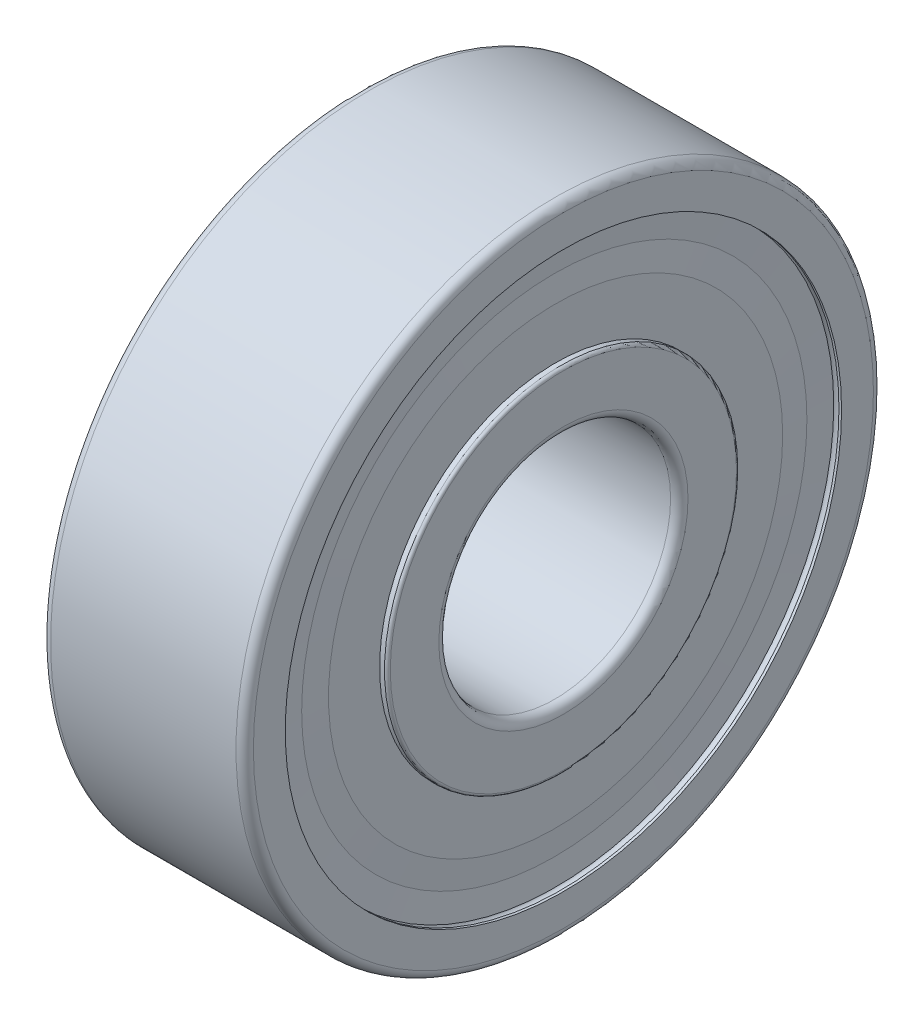
ISO-10303-21;
HEADER;
FILE_DESCRIPTION(('STEP AP214'),'2;1');
FILE_NAME('part.step','',(''),(''),'','','');
FILE_SCHEMA(('AUTOMOTIVE_DESIGN { 1 0 10303 214 1 1 1 1 }'));
ENDSEC;
DATA;
#1=APPLICATION_CONTEXT('core data for automotive mechanical design processes');
#2=APPLICATION_PROTOCOL_DEFINITION('international standard','automotive_design',2000,#1);
#3=PRODUCT_CONTEXT('',#1,'mechanical');
#4=PRODUCT('Part','Part','',(#3));
#5=PRODUCT_RELATED_PRODUCT_CATEGORY('part','',(#4));
#6=PRODUCT_DEFINITION_FORMATION('','',#4);
#7=PRODUCT_DEFINITION_CONTEXT('part definition',#1,'design');
#8=PRODUCT_DEFINITION('design','',#6,#7);
#9=PRODUCT_DEFINITION_SHAPE('','',#8);
#10=(LENGTH_UNIT() NAMED_UNIT(*) SI_UNIT(.MILLI.,.METRE.));
#11=(NAMED_UNIT(*) PLANE_ANGLE_UNIT() SI_UNIT($,.RADIAN.));
#12=(NAMED_UNIT(*) SI_UNIT($,.STERADIAN.) SOLID_ANGLE_UNIT());
#13=UNCERTAINTY_MEASURE_WITH_UNIT(LENGTH_MEASURE(1.E-05),#10,'distance_accuracy_value','');
#14=(GEOMETRIC_REPRESENTATION_CONTEXT(3) GLOBAL_UNCERTAINTY_ASSIGNED_CONTEXT((#13)) GLOBAL_UNIT_ASSIGNED_CONTEXT((#10,
#11,#12)) REPRESENTATION_CONTEXT('',''));
#15=CARTESIAN_POINT('',(0.,0.,0.));
#16=DIRECTION('',(0.,0.,1.));
#17=DIRECTION('',(1.,0.,0.));
#18=AXIS2_PLACEMENT_3D('',#15,#16,#17);
#19=CARTESIAN_POINT('',(6.64,0.,0.));
#20=DIRECTION('',(1.,0.,0.));
#21=DIRECTION('',(0.,0.,-1.));
#22=AXIS2_PLACEMENT_3D('',#19,#20,#21);
#23=CONICAL_SURFACE('',#22,9.6,1.4690215275);
#24=CARTESIAN_POINT('',(6.55,0.,0.));
#25=DIRECTION('',(1.,0.,0.));
#26=DIRECTION('',(0.,0.,-1.));
#27=AXIS2_PLACEMENT_3D('',#24,#25,#26);
#28=CIRCLE('',#27,8.71875);
#29=CARTESIAN_POINT('',(6.55,0.,-8.71875));
#30=VERTEX_POINT('',#29);
#31=EDGE_CURVE('P0_E562',#30,#30,#28,.T.);
#32=ORIENTED_EDGE('',*,*,#31,.T.);
#33=EDGE_LOOP('',(#32));
#34=FACE_BOUND('',#33,.T.);
#35=CARTESIAN_POINT('',(6.64,0.,0.));
#36=DIRECTION('',(1.,0.,0.));
#37=DIRECTION('',(0.,0.,-1.));
#38=AXIS2_PLACEMENT_3D('',#35,#36,#37);
#39=CIRCLE('',#38,9.6);
#40=CARTESIAN_POINT('',(6.64,0.,-9.6));
#41=VERTEX_POINT('',#40);
#42=EDGE_CURVE('P0_E11',#41,#41,#39,.T.);
#43=ORIENTED_EDGE('',*,*,#42,.F.);
#44=EDGE_LOOP('',(#43));
#45=FACE_BOUND('',#44,.T.);
#46=ADVANCED_FACE('P0_F16',(#34,#45),#23,.T.);
#47=CARTESIAN_POINT('',(50.,0.,0.));
#48=DIRECTION('',(-1.,0.,0.));
#49=DIRECTION('',(0.,0.,-1.));
#50=AXIS2_PLACEMENT_3D('',#47,#48,#49);
#51=CYLINDRICAL_SURFACE('',#50,9.6);
#52=ORIENTED_EDGE('',*,*,#42,.T.);
#53=EDGE_LOOP('',(#52));
#54=FACE_BOUND('',#53,.T.);
#55=CARTESIAN_POINT('',(6.73,0.,0.));
#56=DIRECTION('',(1.,0.,0.));
#57=DIRECTION('',(0.,0.,-1.));
#58=AXIS2_PLACEMENT_3D('',#55,#56,#57);
#59=CIRCLE('',#58,9.6);
#60=CARTESIAN_POINT('',(6.73,0.,-9.6));
#61=VERTEX_POINT('',#60);
#62=EDGE_CURVE('P0_E27',#61,#61,#59,.T.);
#63=ORIENTED_EDGE('',*,*,#62,.F.);
#64=EDGE_LOOP('',(#63));
#65=FACE_BOUND('',#64,.T.);
#66=ADVANCED_FACE('P0_F224',(#54,#65),#51,.T.);
#67=CARTESIAN_POINT('',(6.685,0.,0.));
#68=DIRECTION('',(1.,0.,0.));
#69=DIRECTION('',(0.,0.,-1.));
#70=AXIS2_PLACEMENT_3D('',#67,#68,#69);
#71=CONICAL_SURFACE('',#70,8.71875,1.5197768109);
#72=CARTESIAN_POINT('',(6.685,0.,0.));
#73=DIRECTION('',(1.,0.,0.));
#74=DIRECTION('',(0.,0.,-1.));
#75=AXIS2_PLACEMENT_3D('',#72,#73,#74);
#76=CIRCLE('',#75,8.71875);
#77=CARTESIAN_POINT('',(6.685,0.,-8.71875));
#78=VERTEX_POINT('',#77);
#79=EDGE_CURVE('P0_E143',#78,#78,#76,.T.);
#80=ORIENTED_EDGE('',*,*,#79,.F.);
#81=EDGE_LOOP('',(#80));
#82=FACE_BOUND('',#81,.T.);
#83=ORIENTED_EDGE('',*,*,#62,.T.);
#84=EDGE_LOOP('',(#83));
#85=FACE_BOUND('',#84,.T.);
#86=ADVANCED_FACE('P0_F230',(#82,#85),#71,.F.);
#87=CARTESIAN_POINT('',(6.73,0.,0.));
#88=DIRECTION('',(-1.,0.,0.));
#89=DIRECTION('',(0.,0.,1.));
#90=AXIS2_PLACEMENT_3D('',#87,#88,#89);
#91=CONICAL_SURFACE('',#90,7.8375,1.5197768109);
#92=CARTESIAN_POINT('',(6.73,0.,0.));
#93=DIRECTION('',(1.,0.,0.));
#94=DIRECTION('',(0.,0.,-1.));
#95=AXIS2_PLACEMENT_3D('',#92,#93,#94);
#96=CIRCLE('',#95,7.8375);
#97=CARTESIAN_POINT('',(6.73,0.,-7.8375));
#98=VERTEX_POINT('',#97);
#99=EDGE_CURVE('P0_E146',#98,#98,#96,.T.);
#100=ORIENTED_EDGE('',*,*,#99,.F.);
#101=EDGE_LOOP('',(#100));
#102=FACE_BOUND('',#101,.T.);
#103=ORIENTED_EDGE('',*,*,#79,.T.);
#104=EDGE_LOOP('',(#103));
#105=FACE_BOUND('',#104,.T.);
#106=ADVANCED_FACE('P0_F246',(#102,#105),#91,.T.);
#107=CARTESIAN_POINT('',(6.73,6.075,0.));
#108=DIRECTION('',(1.,0.,0.));
#109=DIRECTION('',(0.,1.,0.));
#110=AXIS2_PLACEMENT_3D('',#107,#108,#109);
#111=PLANE('',#110);
#112=CARTESIAN_POINT('',(6.73,0.,0.));
#113=DIRECTION('',(1.,0.,0.));
#114=DIRECTION('',(0.,0.,-1.));
#115=AXIS2_PLACEMENT_3D('',#112,#113,#114);
#116=CIRCLE('',#115,6.075);
#117=CARTESIAN_POINT('',(6.73,0.,-6.075));
#118=VERTEX_POINT('',#117);
#119=EDGE_CURVE('P0_E120',#118,#118,#116,.T.);
#120=ORIENTED_EDGE('',*,*,#119,.F.);
#121=EDGE_LOOP('',(#120));
#122=FACE_BOUND('',#121,.T.);
#123=ORIENTED_EDGE('',*,*,#99,.T.);
#124=EDGE_LOOP('',(#123));
#125=FACE_BOUND('',#124,.T.);
#126=ADVANCED_FACE('P0_F249',(#122,#125),#111,.T.);
#127=CARTESIAN_POINT('',(50.,0.,0.));
#128=DIRECTION('',(-1.,0.,0.));
#129=DIRECTION('',(0.,0.,-1.));
#130=AXIS2_PLACEMENT_3D('',#127,#128,#129);
#131=CYLINDRICAL_SURFACE('',#130,6.075);
#132=CARTESIAN_POINT('',(0.36,0.,0.));
#133=DIRECTION('',(1.,0.,0.));
#134=DIRECTION('',(0.,0.,-1.));
#135=AXIS2_PLACEMENT_3D('',#132,#133,#134);
#136=CIRCLE('',#135,6.075);
#137=CARTESIAN_POINT('',(0.36,0.,-6.075));
#138=VERTEX_POINT('',#137);
#139=EDGE_CURVE('P0_E167',#138,#138,#136,.T.);
#140=ORIENTED_EDGE('',*,*,#139,.T.);
#141=EDGE_LOOP('',(#140));
#142=FACE_BOUND('',#141,.T.);
#143=CARTESIAN_POINT('',(1.979271473931,0.,0.));
#144=DIRECTION('',(1.,0.,0.));
#145=DIRECTION('',(0.,0.,-1.));
#146=AXIS2_PLACEMENT_3D('',#143,#144,#145);
#147=CIRCLE('',#146,6.075);
#148=CARTESIAN_POINT('',(1.979271473931,0.,-6.075));
#149=VERTEX_POINT('',#148);
#150=EDGE_CURVE('P0_E127',#149,#149,#147,.T.);
#151=ORIENTED_EDGE('',*,*,#150,.F.);
#152=EDGE_LOOP('',(#151));
#153=FACE_BOUND('',#152,.T.);
#154=ADVANCED_FACE('P0_F244',(#142,#153),#131,.T.);
#155=CARTESIAN_POINT('',(0.36,0.,0.));
#156=DIRECTION('',(1.,0.,0.));
#157=DIRECTION('',(0.,0.,-1.));
#158=AXIS2_PLACEMENT_3D('',#155,#156,#157);
#159=CONICAL_SURFACE('',#158,6.075,1.5197768109);
#160=ORIENTED_EDGE('',*,*,#139,.F.);
#161=EDGE_LOOP('',(#160));
#162=FACE_BOUND('',#161,.T.);
#163=CARTESIAN_POINT('',(0.45,0.,0.));
#164=DIRECTION('',(1.,0.,0.));
#165=DIRECTION('',(0.,0.,-1.));
#166=AXIS2_PLACEMENT_3D('',#163,#164,#165);
#167=CIRCLE('',#166,7.8375);
#168=CARTESIAN_POINT('',(0.45,0.,-7.8375));
#169=VERTEX_POINT('',#168);
#170=EDGE_CURVE('P0_E169',#169,#169,#167,.T.);
#171=ORIENTED_EDGE('',*,*,#170,.T.);
#172=EDGE_LOOP('',(#171));
#173=FACE_BOUND('',#172,.T.);
#174=ADVANCED_FACE('P0_F240',(#162,#173),#159,.F.);
#175=CARTESIAN_POINT('',(0.45,7.8375,0.));
#176=DIRECTION('',(1.,0.,0.));
#177=DIRECTION('',(0.,1.,0.));
#178=AXIS2_PLACEMENT_3D('',#175,#176,#177);
#179=PLANE('',#178);
#180=ORIENTED_EDGE('',*,*,#170,.F.);
#181=EDGE_LOOP('',(#180));
#182=FACE_BOUND('',#181,.T.);
#183=CARTESIAN_POINT('',(0.45,0.,0.));
#184=DIRECTION('',(1.,0.,0.));
#185=DIRECTION('',(0.,0.,-1.));
#186=AXIS2_PLACEMENT_3D('',#183,#184,#185);
#187=CIRCLE('',#186,8.71875);
#188=CARTESIAN_POINT('',(0.45,0.,-8.71875));
#189=VERTEX_POINT('',#188);
#190=EDGE_CURVE('P0_E177',#189,#189,#187,.T.);
#191=ORIENTED_EDGE('',*,*,#190,.T.);
#192=EDGE_LOOP('',(#191));
#193=FACE_BOUND('',#192,.T.);
#194=ADVANCED_FACE('P0_F243',(#182,#193),#179,.T.);
#195=CARTESIAN_POINT('',(50.,0.,0.));
#196=DIRECTION('',(-1.,0.,0.));
#197=DIRECTION('',(0.,0.,-1.));
#198=AXIS2_PLACEMENT_3D('',#195,#196,#197);
#199=CYLINDRICAL_SURFACE('',#198,9.6);
#200=CARTESIAN_POINT('',(0.27,0.,0.));
#201=DIRECTION('',(1.,0.,0.));
#202=DIRECTION('',(0.,0.,-1.));
#203=AXIS2_PLACEMENT_3D('',#200,#201,#202);
#204=CIRCLE('',#203,9.6);
#205=CARTESIAN_POINT('',(0.27,0.,-9.6));
#206=VERTEX_POINT('',#205);
#207=EDGE_CURVE('P0_E20',#206,#206,#204,.T.);
#208=ORIENTED_EDGE('',*,*,#207,.T.);
#209=EDGE_LOOP('',(#208));
#210=FACE_BOUND('',#209,.T.);
#211=CARTESIAN_POINT('',(0.36,0.,0.));
#212=DIRECTION('',(1.,0.,0.));
#213=DIRECTION('',(0.,0.,-1.));
#214=AXIS2_PLACEMENT_3D('',#211,#212,#213);
#215=CIRCLE('',#214,9.6);
#216=CARTESIAN_POINT('',(0.36,0.,-9.6));
#217=VERTEX_POINT('',#216);
#218=EDGE_CURVE('P0_E173',#217,#217,#215,.T.);
#219=ORIENTED_EDGE('',*,*,#218,.F.);
#220=EDGE_LOOP('',(#219));
#221=FACE_BOUND('',#220,.T.);
#222=ADVANCED_FACE('P0_F258',(#210,#221),#199,.T.);
#223=CARTESIAN_POINT('',(0.27,0.,0.));
#224=DIRECTION('',(-1.,0.,0.));
#225=DIRECTION('',(0.,0.,1.));
#226=AXIS2_PLACEMENT_3D('',#223,#224,#225);
#227=CONICAL_SURFACE('',#226,9.6,1.5197768109);
#228=CARTESIAN_POINT('',(0.315,0.,0.));
#229=DIRECTION('',(1.,0.,0.));
#230=DIRECTION('',(0.,0.,-1.));
#231=AXIS2_PLACEMENT_3D('',#228,#229,#230);
#232=CIRCLE('',#231,8.71875);
#233=CARTESIAN_POINT('',(0.315,0.,-8.71875));
#234=VERTEX_POINT('',#233);
#235=EDGE_CURVE('P0_E182',#234,#234,#232,.T.);
#236=ORIENTED_EDGE('',*,*,#235,.T.);
#237=EDGE_LOOP('',(#236));
#238=FACE_BOUND('',#237,.T.);
#239=ORIENTED_EDGE('',*,*,#207,.F.);
#240=EDGE_LOOP('',(#239));
#241=FACE_BOUND('',#240,.T.);
#242=ADVANCED_FACE('P0_F219',(#238,#241),#227,.F.);
#243=CARTESIAN_POINT('',(0.315,0.,0.));
#244=DIRECTION('',(1.,0.,0.));
#245=DIRECTION('',(0.,0.,-1.));
#246=AXIS2_PLACEMENT_3D('',#243,#244,#245);
#247=CONICAL_SURFACE('',#246,8.71875,1.5197768109);
#248=CARTESIAN_POINT('',(0.27,0.,0.));
#249=DIRECTION('',(1.,0.,0.));
#250=DIRECTION('',(0.,0.,-1.));
#251=AXIS2_PLACEMENT_3D('',#248,#249,#250);
#252=CIRCLE('',#251,7.8375);
#253=CARTESIAN_POINT('',(0.27,0.,-7.8375));
#254=VERTEX_POINT('',#253);
#255=EDGE_CURVE('P0_E185',#254,#254,#252,.T.);
#256=ORIENTED_EDGE('',*,*,#255,.T.);
#257=EDGE_LOOP('',(#256));
#258=FACE_BOUND('',#257,.T.);
#259=ORIENTED_EDGE('',*,*,#235,.F.);
#260=EDGE_LOOP('',(#259));
#261=FACE_BOUND('',#260,.T.);
#262=ADVANCED_FACE('P0_F202',(#258,#261),#247,.T.);
#263=CARTESIAN_POINT('',(0.27,7.8375,0.));
#264=DIRECTION('',(-1.,0.,0.));
#265=DIRECTION('',(0.,0.,1.));
#266=AXIS2_PLACEMENT_3D('',#263,#264,#265);
#267=PLANE('',#266);
#268=CARTESIAN_POINT('',(0.27,0.,0.));
#269=DIRECTION('',(1.,0.,0.));
#270=DIRECTION('',(0.,0.,-1.));
#271=AXIS2_PLACEMENT_3D('',#268,#269,#270);
#272=CIRCLE('',#271,6.075);
#273=CARTESIAN_POINT('',(0.27,0.,-6.075));
#274=VERTEX_POINT('',#273);
#275=EDGE_CURVE('P0_E130',#274,#274,#272,.T.);
#276=ORIENTED_EDGE('',*,*,#275,.T.);
#277=EDGE_LOOP('',(#276));
#278=FACE_BOUND('',#277,.T.);
#279=ORIENTED_EDGE('',*,*,#255,.F.);
#280=EDGE_LOOP('',(#279));
#281=FACE_BOUND('',#280,.T.);
#282=ADVANCED_FACE('P0_F207',(#278,#281),#267,.T.);
#283=CARTESIAN_POINT('',(0.1,0.,0.));
#284=DIRECTION('',(1.,0.,0.));
#285=DIRECTION('',(0.,0.,-1.));
#286=AXIS2_PLACEMENT_3D('',#283,#284,#285);
#287=TOROIDAL_SURFACE('',#286,5.975,0.1);
#288=CARTESIAN_POINT('',(0.,0.,0.));
#289=DIRECTION('',(1.,0.,0.));
#290=DIRECTION('',(0.,0.,-1.));
#291=AXIS2_PLACEMENT_3D('',#288,#289,#290);
#292=CIRCLE('',#291,5.975);
#293=CARTESIAN_POINT('',(0.,0.,-5.975));
#294=VERTEX_POINT('',#293);
#295=EDGE_CURVE('P0_E142',#294,#294,#292,.T.);
#296=ORIENTED_EDGE('',*,*,#295,.T.);
#297=EDGE_LOOP('',(#296));
#298=FACE_BOUND('',#297,.T.);
#299=CARTESIAN_POINT('',(0.100000000000003,0.,0.));
#300=DIRECTION('',(1.,0.,0.));
#301=DIRECTION('',(0.,0.,-1.));
#302=AXIS2_PLACEMENT_3D('',#299,#300,#301);
#303=CIRCLE('',#302,6.075);
#304=CARTESIAN_POINT('',(0.100000000000003,0.,-6.075));
#305=VERTEX_POINT('',#304);
#306=EDGE_CURVE('P0_E121',#305,#305,#303,.T.);
#307=ORIENTED_EDGE('',*,*,#306,.F.);
#308=EDGE_LOOP('',(#307));
#309=FACE_BOUND('',#308,.T.);
#310=ADVANCED_FACE('P0_F209',(#298,#309),#287,.T.);
#311=CARTESIAN_POINT('',(0.,5.975,0.));
#312=DIRECTION('',(-1.,0.,0.));
#313=DIRECTION('',(0.,0.,1.));
#314=AXIS2_PLACEMENT_3D('',#311,#312,#313);
#315=PLANE('',#314);
#316=CARTESIAN_POINT('',(0.,0.,0.));
#317=DIRECTION('',(1.,0.,0.));
#318=DIRECTION('',(0.,0.,-1.));
#319=AXIS2_PLACEMENT_3D('',#316,#317,#318);
#320=CIRCLE('',#319,4.3);
#321=CARTESIAN_POINT('',(0.,0.,-4.3));
#322=VERTEX_POINT('',#321);
#323=EDGE_CURVE('P0_E138',#322,#322,#320,.T.);
#324=ORIENTED_EDGE('',*,*,#323,.T.);
#325=EDGE_LOOP('',(#324));
#326=FACE_BOUND('',#325,.T.);
#327=ORIENTED_EDGE('',*,*,#295,.F.);
#328=EDGE_LOOP('',(#327));
#329=FACE_BOUND('',#328,.T.);
#330=ADVANCED_FACE('P0_F18',(#326,#329),#315,.T.);
#331=CARTESIAN_POINT('',(0.3,0.,0.));
#332=DIRECTION('',(1.,0.,0.));
#333=DIRECTION('',(0.,0.,-1.));
#334=AXIS2_PLACEMENT_3D('',#331,#332,#333);
#335=TOROIDAL_SURFACE('',#334,4.3,0.3);
#336=CARTESIAN_POINT('',(0.3,0.,0.));
#337=DIRECTION('',(1.,0.,0.));
#338=DIRECTION('',(0.,0.,-1.));
#339=AXIS2_PLACEMENT_3D('',#336,#337,#338);
#340=CIRCLE('',#339,4.);
#341=CARTESIAN_POINT('',(0.3,0.,-4.));
#342=VERTEX_POINT('',#341);
#343=EDGE_CURVE('P0_E136',#342,#342,#340,.T.);
#344=ORIENTED_EDGE('',*,*,#343,.T.);
#345=EDGE_LOOP('',(#344));
#346=FACE_BOUND('',#345,.T.);
#347=ORIENTED_EDGE('',*,*,#323,.F.);
#348=EDGE_LOOP('',(#347));
#349=FACE_BOUND('',#348,.T.);
#350=ADVANCED_FACE('P0_F238',(#346,#349),#335,.T.);
#351=CARTESIAN_POINT('',(50.,0.,0.));
#352=DIRECTION('',(-1.,0.,0.));
#353=DIRECTION('',(0.,0.,-1.));
#354=AXIS2_PLACEMENT_3D('',#351,#352,#353);
#355=CYLINDRICAL_SURFACE('',#354,4.);
#356=CARTESIAN_POINT('',(6.7,0.,0.));
#357=DIRECTION('',(1.,0.,0.));
#358=DIRECTION('',(0.,0.,-1.));
#359=AXIS2_PLACEMENT_3D('',#356,#357,#358);
#360=CIRCLE('',#359,4.);
#361=CARTESIAN_POINT('',(6.7,0.,-4.));
#362=VERTEX_POINT('',#361);
#363=EDGE_CURVE('P0_E139',#362,#362,#360,.T.);
#364=ORIENTED_EDGE('',*,*,#363,.T.);
#365=EDGE_LOOP('',(#364));
#366=FACE_BOUND('',#365,.T.);
#367=ORIENTED_EDGE('',*,*,#343,.F.);
#368=EDGE_LOOP('',(#367));
#369=FACE_BOUND('',#368,.T.);
#370=ADVANCED_FACE('P0_F234',(#366,#369),#355,.F.);
#371=CARTESIAN_POINT('',(6.7,0.,0.));
#372=DIRECTION('',(1.,0.,0.));
#373=DIRECTION('',(0.,0.,-1.));
#374=AXIS2_PLACEMENT_3D('',#371,#372,#373);
#375=TOROIDAL_SURFACE('',#374,4.3,0.3);
#376=CARTESIAN_POINT('',(7.,0.,0.));
#377=DIRECTION('',(1.,0.,0.));
#378=DIRECTION('',(0.,0.,-1.));
#379=AXIS2_PLACEMENT_3D('',#376,#377,#378);
#380=CIRCLE('',#379,4.3);
#381=CARTESIAN_POINT('',(7.,0.,-4.3));
#382=VERTEX_POINT('',#381);
#383=EDGE_CURVE('P0_E150',#382,#382,#380,.T.);
#384=ORIENTED_EDGE('',*,*,#383,.T.);
#385=EDGE_LOOP('',(#384));
#386=FACE_BOUND('',#385,.T.);
#387=ORIENTED_EDGE('',*,*,#363,.F.);
#388=EDGE_LOOP('',(#387));
#389=FACE_BOUND('',#388,.T.);
#390=ADVANCED_FACE('P0_F237',(#386,#389),#375,.T.);
#391=CARTESIAN_POINT('',(7.,4.3,0.));
#392=DIRECTION('',(1.,0.,0.));
#393=DIRECTION('',(0.,1.,0.));
#394=AXIS2_PLACEMENT_3D('',#391,#392,#393);
#395=PLANE('',#394);
#396=ORIENTED_EDGE('',*,*,#383,.F.);
#397=EDGE_LOOP('',(#396));
#398=FACE_BOUND('',#397,.T.);
#399=CARTESIAN_POINT('',(7.,0.,0.));
#400=DIRECTION('',(1.,0.,0.));
#401=DIRECTION('',(0.,0.,-1.));
#402=AXIS2_PLACEMENT_3D('',#399,#400,#401);
#403=CIRCLE('',#402,5.975);
#404=CARTESIAN_POINT('',(7.,0.,-5.975));
#405=VERTEX_POINT('',#404);
#406=EDGE_CURVE('P0_E147',#405,#405,#403,.T.);
#407=ORIENTED_EDGE('',*,*,#406,.T.);
#408=EDGE_LOOP('',(#407));
#409=FACE_BOUND('',#408,.T.);
#410=ADVANCED_FACE('P0_F439',(#398,#409),#395,.T.);
#411=CARTESIAN_POINT('',(6.9,0.,0.));
#412=DIRECTION('',(1.,0.,0.));
#413=DIRECTION('',(0.,0.,-1.));
#414=AXIS2_PLACEMENT_3D('',#411,#412,#413);
#415=TOROIDAL_SURFACE('',#414,5.975,0.1);
#416=CARTESIAN_POINT('',(6.9,0.,0.));
#417=DIRECTION('',(1.,0.,0.));
#418=DIRECTION('',(0.,0.,-1.));
#419=AXIS2_PLACEMENT_3D('',#416,#417,#418);
#420=CIRCLE('',#419,6.075);
#421=CARTESIAN_POINT('',(6.9,0.,-6.075));
#422=VERTEX_POINT('',#421);
#423=EDGE_CURVE('P0_E115',#422,#422,#420,.T.);
#424=ORIENTED_EDGE('',*,*,#423,.T.);
#425=EDGE_LOOP('',(#424));
#426=FACE_BOUND('',#425,.T.);
#427=ORIENTED_EDGE('',*,*,#406,.F.);
#428=EDGE_LOOP('',(#427));
#429=FACE_BOUND('',#428,.T.);
#430=ADVANCED_FACE('P0_F116',(#426,#429),#415,.T.);
#431=CARTESIAN_POINT('',(3.5,0.,0.));
#432=DIRECTION('',(1.,0.,0.));
#433=DIRECTION('',(0.,0.,-1.));
#434=AXIS2_PLACEMENT_3D('',#431,#432,#433);
#435=TOROIDAL_SURFACE('',#434,7.35,1.9845);
#436=CARTESIAN_POINT('',(5.020728526069,0.,0.));
#437=DIRECTION('',(1.,0.,0.));
#438=DIRECTION('',(0.,0.,-1.));
#439=AXIS2_PLACEMENT_3D('',#436,#437,#438);
#440=CIRCLE('',#439,6.075);
#441=CARTESIAN_POINT('',(5.020728526069,0.,-6.075));
#442=VERTEX_POINT('',#441);
#443=EDGE_CURVE('P0_E181',#442,#442,#440,.T.);
#444=ORIENTED_EDGE('',*,*,#443,.F.);
#445=EDGE_LOOP('',(#444));
#446=FACE_BOUND('',#445,.T.);
#447=ORIENTED_EDGE('',*,*,#150,.T.);
#448=EDGE_LOOP('',(#447));
#449=FACE_BOUND('',#448,.T.);
#450=ADVANCED_FACE('P0_F254',(#446,#449),#435,.F.);
#451=CARTESIAN_POINT('',(50.,0.,0.));
#452=DIRECTION('',(-1.,0.,0.));
#453=DIRECTION('',(0.,0.,-1.));
#454=AXIS2_PLACEMENT_3D('',#451,#452,#453);
#455=CYLINDRICAL_SURFACE('',#454,6.075);
#456=ORIENTED_EDGE('',*,*,#119,.T.);
#457=EDGE_LOOP('',(#456));
#458=FACE_BOUND('',#457,.T.);
#459=ORIENTED_EDGE('',*,*,#423,.F.);
#460=EDGE_LOOP('',(#459));
#461=FACE_BOUND('',#460,.T.);
#462=ADVANCED_FACE('P0_F251',(#458,#461),#455,.T.);
#463=CARTESIAN_POINT('',(50.,0.,0.));
#464=DIRECTION('',(-1.,0.,0.));
#465=DIRECTION('',(0.,0.,-1.));
#466=AXIS2_PLACEMENT_3D('',#463,#464,#465);
#467=CYLINDRICAL_SURFACE('',#466,6.075);
#468=ORIENTED_EDGE('',*,*,#306,.T.);
#469=EDGE_LOOP('',(#468));
#470=FACE_BOUND('',#469,.T.);
#471=ORIENTED_EDGE('',*,*,#275,.F.);
#472=EDGE_LOOP('',(#471));
#473=FACE_BOUND('',#472,.T.);
#474=ADVANCED_FACE('P0_F253',(#470,#473),#467,.T.);
#475=CARTESIAN_POINT('',(50.,0.,0.));
#476=DIRECTION('',(-1.,0.,0.));
#477=DIRECTION('',(0.,0.,-1.));
#478=AXIS2_PLACEMENT_3D('',#475,#476,#477);
#479=CYLINDRICAL_SURFACE('',#478,6.075);
#480=ORIENTED_EDGE('',*,*,#443,.T.);
#481=EDGE_LOOP('',(#480));
#482=FACE_BOUND('',#481,.T.);
#483=CARTESIAN_POINT('',(6.64,0.,0.));
#484=DIRECTION('',(1.,0.,0.));
#485=DIRECTION('',(0.,0.,-1.));
#486=AXIS2_PLACEMENT_3D('',#483,#484,#485);
#487=CIRCLE('',#486,6.075);
#488=CARTESIAN_POINT('',(6.64,0.,-6.075));
#489=VERTEX_POINT('',#488);
#490=EDGE_CURVE('P0_E178',#489,#489,#487,.T.);
#491=ORIENTED_EDGE('',*,*,#490,.F.);
#492=EDGE_LOOP('',(#491));
#493=FACE_BOUND('',#492,.T.);
#494=ADVANCED_FACE('P0_F265',(#482,#493),#479,.T.);
#495=CARTESIAN_POINT('',(0.45,0.,0.));
#496=DIRECTION('',(-1.,0.,0.));
#497=DIRECTION('',(0.,0.,1.));
#498=AXIS2_PLACEMENT_3D('',#495,#496,#497);
#499=CONICAL_SURFACE('',#498,8.71875,1.4690215275);
#500=ORIENTED_EDGE('',*,*,#190,.F.);
#501=EDGE_LOOP('',(#500));
#502=FACE_BOUND('',#501,.T.);
#503=ORIENTED_EDGE('',*,*,#218,.T.);
#504=EDGE_LOOP('',(#503));
#505=FACE_BOUND('',#504,.T.);
#506=ADVANCED_FACE('P0_F449',(#502,#505),#499,.T.);
#507=CARTESIAN_POINT('',(6.55,0.,0.));
#508=DIRECTION('',(-1.,0.,0.));
#509=DIRECTION('',(0.,0.,1.));
#510=AXIS2_PLACEMENT_3D('',#507,#508,#509);
#511=CONICAL_SURFACE('',#510,7.8375,1.5197768109);
#512=ORIENTED_EDGE('',*,*,#490,.T.);
#513=EDGE_LOOP('',(#512));
#514=FACE_BOUND('',#513,.T.);
#515=CARTESIAN_POINT('',(6.55,0.,0.));
#516=DIRECTION('',(1.,0.,0.));
#517=DIRECTION('',(0.,0.,-1.));
#518=AXIS2_PLACEMENT_3D('',#515,#516,#517);
#519=CIRCLE('',#518,7.8375);
#520=CARTESIAN_POINT('',(6.55,0.,-7.8375));
#521=VERTEX_POINT('',#520);
#522=EDGE_CURVE('P0_E134',#521,#521,#519,.T.);
#523=ORIENTED_EDGE('',*,*,#522,.F.);
#524=EDGE_LOOP('',(#523));
#525=FACE_BOUND('',#524,.T.);
#526=ADVANCED_FACE('P0_F433',(#514,#525),#511,.F.);
#527=CARTESIAN_POINT('',(6.55,8.71875,0.));
#528=DIRECTION('',(-1.,0.,0.));
#529=DIRECTION('',(0.,0.,1.));
#530=AXIS2_PLACEMENT_3D('',#527,#528,#529);
#531=PLANE('',#530);
#532=ORIENTED_EDGE('',*,*,#522,.T.);
#533=EDGE_LOOP('',(#532));
#534=FACE_BOUND('',#533,.T.);
#535=ORIENTED_EDGE('',*,*,#31,.F.);
#536=EDGE_LOOP('',(#535));
#537=FACE_BOUND('',#536,.T.);
#538=ADVANCED_FACE('P0_F428',(#534,#537),#531,.T.);
#539=CLOSED_SHELL('',(#46,#66,#86,#106,#126,#154,#174,#194,#222,#242,#262,#282,#310,#330,#350,
#370,#390,#410,#430,#450,#462,#474,#494,#506,#526,#538));
#540=MANIFOLD_SOLID_BREP('P0_B1',#539);
#541=CARTESIAN_POINT('',(0.3,0.,0.));
#542=DIRECTION('',(1.,0.,0.));
#543=DIRECTION('',(0.,0.,-1.));
#544=AXIS2_PLACEMENT_3D('',#541,#542,#543);
#545=TOROIDAL_SURFACE('',#544,10.7,0.3);
#546=CARTESIAN_POINT('',(0.,0.,0.));
#547=DIRECTION('',(1.,0.,0.));
#548=DIRECTION('',(0.,0.,-1.));
#549=AXIS2_PLACEMENT_3D('',#546,#547,#548);
#550=CIRCLE('',#549,10.7);
#551=CARTESIAN_POINT('',(0.,0.,-10.7));
#552=VERTEX_POINT('',#551);
#553=EDGE_CURVE('P1_E191',#552,#552,#550,.T.);
#554=ORIENTED_EDGE('',*,*,#553,.T.);
#555=EDGE_LOOP('',(#554));
#556=FACE_BOUND('',#555,.T.);
#557=CARTESIAN_POINT('',(0.3,0.,0.));
#558=DIRECTION('',(1.,0.,0.));
#559=DIRECTION('',(0.,0.,-1.));
#560=AXIS2_PLACEMENT_3D('',#557,#558,#559);
#561=CIRCLE('',#560,11.);
#562=CARTESIAN_POINT('',(0.3,0.,-11.));
#563=VERTEX_POINT('',#562);
#564=EDGE_CURVE('P1_E11',#563,#563,#561,.T.);
#565=ORIENTED_EDGE('',*,*,#564,.F.);
#566=EDGE_LOOP('',(#565));
#567=FACE_BOUND('',#566,.T.);
#568=ADVANCED_FACE('P1_F16',(#556,#567),#545,.T.);
#569=CARTESIAN_POINT('',(50.,0.,0.));
#570=DIRECTION('',(-1.,0.,0.));
#571=DIRECTION('',(0.,0.,-1.));
#572=AXIS2_PLACEMENT_3D('',#569,#570,#571);
#573=CYLINDRICAL_SURFACE('',#572,11.);
#574=ORIENTED_EDGE('',*,*,#564,.T.);
#575=EDGE_LOOP('',(#574));
#576=FACE_BOUND('',#575,.T.);
#577=CARTESIAN_POINT('',(6.7,0.,0.));
#578=DIRECTION('',(1.,0.,0.));
#579=DIRECTION('',(0.,0.,-1.));
#580=AXIS2_PLACEMENT_3D('',#577,#578,#579);
#581=CIRCLE('',#580,11.);
#582=CARTESIAN_POINT('',(6.7,0.,-11.));
#583=VERTEX_POINT('',#582);
#584=EDGE_CURVE('P1_E27',#583,#583,#581,.T.);
#585=ORIENTED_EDGE('',*,*,#584,.F.);
#586=EDGE_LOOP('',(#585));
#587=FACE_BOUND('',#586,.T.);
#588=ADVANCED_FACE('P1_F158',(#576,#587),#573,.T.);
#589=CARTESIAN_POINT('',(6.7,0.,0.));
#590=DIRECTION('',(1.,0.,0.));
#591=DIRECTION('',(0.,0.,-1.));
#592=AXIS2_PLACEMENT_3D('',#589,#590,#591);
#593=TOROIDAL_SURFACE('',#592,10.7,0.3);
#594=ORIENTED_EDGE('',*,*,#584,.T.);
#595=EDGE_LOOP('',(#594));
#596=FACE_BOUND('',#595,.T.);
#597=CARTESIAN_POINT('',(7.,0.,0.));
#598=DIRECTION('',(1.,0.,0.));
#599=DIRECTION('',(0.,0.,-1.));
#600=AXIS2_PLACEMENT_3D('',#597,#598,#599);
#601=CIRCLE('',#600,10.7);
#602=CARTESIAN_POINT('',(7.,0.,-10.7));
#603=VERTEX_POINT('',#602);
#604=EDGE_CURVE('P1_E86',#603,#603,#601,.T.);
#605=ORIENTED_EDGE('',*,*,#604,.F.);
#606=EDGE_LOOP('',(#605));
#607=FACE_BOUND('',#606,.T.);
#608=ADVANCED_FACE('P1_F163',(#596,#607),#593,.T.);
#609=CARTESIAN_POINT('',(7.,9.6,0.));
#610=DIRECTION('',(1.,0.,0.));
#611=DIRECTION('',(0.,1.,0.));
#612=AXIS2_PLACEMENT_3D('',#609,#610,#611);
#613=PLANE('',#612);
#614=CARTESIAN_POINT('',(7.,0.,0.));
#615=DIRECTION('',(1.,0.,0.));
#616=DIRECTION('',(0.,0.,-1.));
#617=AXIS2_PLACEMENT_3D('',#614,#615,#616);
#618=CIRCLE('',#617,9.6);
#619=CARTESIAN_POINT('',(7.,0.,-9.6));
#620=VERTEX_POINT('',#619);
#621=EDGE_CURVE('P1_E95',#620,#620,#618,.T.);
#622=ORIENTED_EDGE('',*,*,#621,.F.);
#623=EDGE_LOOP('',(#622));
#624=FACE_BOUND('',#623,.T.);
#625=ORIENTED_EDGE('',*,*,#604,.T.);
#626=EDGE_LOOP('',(#625));
#627=FACE_BOUND('',#626,.T.);
#628=ADVANCED_FACE('P1_F18',(#624,#627),#613,.T.);
#629=CARTESIAN_POINT('',(50.,0.,0.));
#630=DIRECTION('',(-1.,0.,0.));
#631=DIRECTION('',(0.,0.,-1.));
#632=AXIS2_PLACEMENT_3D('',#629,#630,#631);
#633=CYLINDRICAL_SURFACE('',#632,9.6);
#634=ORIENTED_EDGE('',*,*,#621,.T.);
#635=EDGE_LOOP('',(#634));
#636=FACE_BOUND('',#635,.T.);
#637=CARTESIAN_POINT('',(6.91,0.,0.));
#638=DIRECTION('',(1.,0.,0.));
#639=DIRECTION('',(0.,0.,-1.));
#640=AXIS2_PLACEMENT_3D('',#637,#638,#639);
#641=CIRCLE('',#640,9.6);
#642=CARTESIAN_POINT('',(6.91,0.,-9.6));
#643=VERTEX_POINT('',#642);
#644=EDGE_CURVE('P1_E125',#643,#643,#641,.T.);
#645=ORIENTED_EDGE('',*,*,#644,.F.);
#646=EDGE_LOOP('',(#645));
#647=FACE_BOUND('',#646,.T.);
#648=ADVANCED_FACE('P1_F170',(#636,#647),#633,.F.);
#649=CARTESIAN_POINT('',(6.73,0.,0.));
#650=DIRECTION('',(1.,0.,0.));
#651=DIRECTION('',(0.,0.,-1.));
#652=AXIS2_PLACEMENT_3D('',#649,#650,#651);
#653=TOROIDAL_SURFACE('',#652,9.6,0.18);
#654=CARTESIAN_POINT('',(6.73,0.,-9.78));
#655=VERTEX_POINT('',#654);
#656=VERTEX_LOOP('',#655);
#657=FACE_BOUND('',#656,.T.);
#658=CARTESIAN_POINT('',(6.55,0.,0.));
#659=DIRECTION('',(1.,0.,0.));
#660=DIRECTION('',(0.,0.,-1.));
#661=AXIS2_PLACEMENT_3D('',#658,#659,#660);
#662=CIRCLE('',#661,9.6);
#663=CARTESIAN_POINT('',(6.55,0.,-9.6));
#664=VERTEX_POINT('',#663);
#665=EDGE_CURVE('P1_E118',#664,#664,#662,.T.);
#666=ORIENTED_EDGE('',*,*,#665,.F.);
#667=EDGE_LOOP('',(#666));
#668=FACE_BOUND('',#667,.T.);
#669=ORIENTED_EDGE('',*,*,#644,.T.);
#670=EDGE_LOOP('',(#669));
#671=FACE_BOUND('',#670,.T.);
#672=ADVANCED_FACE('P1_F167',(#657,#668,#671),#653,.F.);
#673=CARTESIAN_POINT('',(6.40893841543323,0.,0.));
#674=DIRECTION('',(1.,0.,0.));
#675=DIRECTION('',(0.,0.,-1.));
#676=AXIS2_PLACEMENT_3D('',#673,#674,#675);
#677=CONICAL_SURFACE('',#676,8.8,1.3962634016);
#678=CARTESIAN_POINT('',(6.40893841543323,0.,0.));
#679=DIRECTION('',(1.,0.,0.));
#680=DIRECTION('',(0.,0.,-1.));
#681=AXIS2_PLACEMENT_3D('',#678,#679,#680);
#682=CIRCLE('',#681,8.8);
#683=CARTESIAN_POINT('',(6.40893841543323,0.,-8.8));
#684=VERTEX_POINT('',#683);
#685=EDGE_CURVE('P1_E111',#684,#684,#682,.T.);
#686=ORIENTED_EDGE('',*,*,#685,.F.);
#687=EDGE_LOOP('',(#686));
#688=FACE_BOUND('',#687,.T.);
#689=ORIENTED_EDGE('',*,*,#665,.T.);
#690=EDGE_LOOP('',(#689));
#691=FACE_BOUND('',#690,.T.);
#692=ADVANCED_FACE('P1_F169',(#688,#691),#677,.F.);
#693=CARTESIAN_POINT('',(50.,0.,0.));
#694=DIRECTION('',(-1.,0.,0.));
#695=DIRECTION('',(0.,0.,-1.));
#696=AXIS2_PLACEMENT_3D('',#693,#694,#695);
#697=CYLINDRICAL_SURFACE('',#696,8.8);
#698=ORIENTED_EDGE('',*,*,#685,.T.);
#699=EDGE_LOOP('',(#698));
#700=FACE_BOUND('',#699,.T.);
#701=CARTESIAN_POINT('',(4.85489492212496,0.,0.));
#702=DIRECTION('',(1.,0.,0.));
#703=DIRECTION('',(0.,0.,-1.));
#704=AXIS2_PLACEMENT_3D('',#701,#702,#703);
#705=CIRCLE('',#704,8.8);
#706=CARTESIAN_POINT('',(4.85489492212496,0.,-8.8));
#707=VERTEX_POINT('',#706);
#708=EDGE_CURVE('P1_E107',#707,#707,#705,.T.);
#709=ORIENTED_EDGE('',*,*,#708,.F.);
#710=EDGE_LOOP('',(#709));
#711=FACE_BOUND('',#710,.T.);
#712=ADVANCED_FACE('P1_F176',(#700,#711),#697,.F.);
#713=CARTESIAN_POINT('',(3.5,0.,0.));
#714=DIRECTION('',(1.,0.,0.));
#715=DIRECTION('',(0.,0.,-1.));
#716=AXIS2_PLACEMENT_3D('',#713,#714,#715);
#717=TOROIDAL_SURFACE('',#716,7.35,1.9845);
#718=CARTESIAN_POINT('',(3.5,0.,-9.3345));
#719=VERTEX_POINT('',#718);
#720=VERTEX_LOOP('',#719);
#721=FACE_BOUND('',#720,.T.);
#722=CARTESIAN_POINT('',(2.14510507787504,0.,0.));
#723=DIRECTION('',(1.,0.,0.));
#724=DIRECTION('',(0.,0.,-1.));
#725=AXIS2_PLACEMENT_3D('',#722,#723,#724);
#726=CIRCLE('',#725,8.8);
#727=CARTESIAN_POINT('',(2.14510507787504,0.,-8.8));
#728=VERTEX_POINT('',#727);
#729=EDGE_CURVE('P1_E112',#728,#728,#726,.T.);
#730=ORIENTED_EDGE('',*,*,#729,.F.);
#731=EDGE_LOOP('',(#730));
#732=FACE_BOUND('',#731,.T.);
#733=ORIENTED_EDGE('',*,*,#708,.T.);
#734=EDGE_LOOP('',(#733));
#735=FACE_BOUND('',#734,.T.);
#736=ADVANCED_FACE('P1_F108',(#721,#732,#735),#717,.F.);
#737=CARTESIAN_POINT('',(50.,0.,0.));
#738=DIRECTION('',(-1.,0.,0.));
#739=DIRECTION('',(0.,0.,-1.));
#740=AXIS2_PLACEMENT_3D('',#737,#738,#739);
#741=CYLINDRICAL_SURFACE('',#740,8.8);
#742=ORIENTED_EDGE('',*,*,#729,.T.);
#743=EDGE_LOOP('',(#742));
#744=FACE_BOUND('',#743,.T.);
#745=CARTESIAN_POINT('',(0.591061584566767,0.,0.));
#746=DIRECTION('',(1.,0.,0.));
#747=DIRECTION('',(0.,0.,-1.));
#748=AXIS2_PLACEMENT_3D('',#745,#746,#747);
#749=CIRCLE('',#748,8.8);
#750=CARTESIAN_POINT('',(0.591061584566767,0.,-8.8));
#751=VERTEX_POINT('',#750);
#752=EDGE_CURVE('P1_E121',#751,#751,#749,.T.);
#753=ORIENTED_EDGE('',*,*,#752,.F.);
#754=EDGE_LOOP('',(#753));
#755=FACE_BOUND('',#754,.T.);
#756=ADVANCED_FACE('P1_F143',(#744,#755),#741,.F.);
#757=CARTESIAN_POINT('',(0.45,0.,0.));
#758=DIRECTION('',(-1.,0.,0.));
#759=DIRECTION('',(0.,0.,1.));
#760=AXIS2_PLACEMENT_3D('',#757,#758,#759);
#761=CONICAL_SURFACE('',#760,9.6,1.3962634016);
#762=ORIENTED_EDGE('',*,*,#752,.T.);
#763=EDGE_LOOP('',(#762));
#764=FACE_BOUND('',#763,.T.);
#765=CARTESIAN_POINT('',(0.45,0.,0.));
#766=DIRECTION('',(1.,0.,0.));
#767=DIRECTION('',(0.,0.,-1.));
#768=AXIS2_PLACEMENT_3D('',#765,#766,#767);
#769=CIRCLE('',#768,9.6);
#770=CARTESIAN_POINT('',(0.45,0.,-9.6));
#771=VERTEX_POINT('',#770);
#772=EDGE_CURVE('P1_E20',#771,#771,#769,.T.);
#773=ORIENTED_EDGE('',*,*,#772,.F.);
#774=EDGE_LOOP('',(#773));
#775=FACE_BOUND('',#774,.T.);
#776=ADVANCED_FACE('P1_F141',(#764,#775),#761,.F.);
#777=CARTESIAN_POINT('',(0.27,0.,0.));
#778=DIRECTION('',(1.,0.,0.));
#779=DIRECTION('',(0.,0.,-1.));
#780=AXIS2_PLACEMENT_3D('',#777,#778,#779);
#781=TOROIDAL_SURFACE('',#780,9.6,0.18);
#782=CARTESIAN_POINT('',(0.27,0.,-9.78));
#783=VERTEX_POINT('',#782);
#784=VERTEX_LOOP('',#783);
#785=FACE_BOUND('',#784,.T.);
#786=CARTESIAN_POINT('',(0.09,0.,0.));
#787=DIRECTION('',(1.,0.,0.));
#788=DIRECTION('',(0.,0.,-1.));
#789=AXIS2_PLACEMENT_3D('',#786,#787,#788);
#790=CIRCLE('',#789,9.6);
#791=CARTESIAN_POINT('',(0.09,0.,-9.6));
#792=VERTEX_POINT('',#791);
#793=EDGE_CURVE('P1_E127',#792,#792,#790,.T.);
#794=ORIENTED_EDGE('',*,*,#793,.F.);
#795=EDGE_LOOP('',(#794));
#796=FACE_BOUND('',#795,.T.);
#797=ORIENTED_EDGE('',*,*,#772,.T.);
#798=EDGE_LOOP('',(#797));
#799=FACE_BOUND('',#798,.T.);
#800=ADVANCED_FACE('P1_F139',(#785,#796,#799),#781,.F.);
#801=CARTESIAN_POINT('',(50.,0.,0.));
#802=DIRECTION('',(-1.,0.,0.));
#803=DIRECTION('',(0.,0.,-1.));
#804=AXIS2_PLACEMENT_3D('',#801,#802,#803);
#805=CYLINDRICAL_SURFACE('',#804,9.6);
#806=ORIENTED_EDGE('',*,*,#793,.T.);
#807=EDGE_LOOP('',(#806));
#808=FACE_BOUND('',#807,.T.);
#809=CARTESIAN_POINT('',(0.,0.,0.));
#810=DIRECTION('',(1.,0.,0.));
#811=DIRECTION('',(0.,0.,-1.));
#812=AXIS2_PLACEMENT_3D('',#809,#810,#811);
#813=CIRCLE('',#812,9.6);
#814=CARTESIAN_POINT('',(0.,0.,-9.6));
#815=VERTEX_POINT('',#814);
#816=EDGE_CURVE('P1_E129',#815,#815,#813,.T.);
#817=ORIENTED_EDGE('',*,*,#816,.F.);
#818=EDGE_LOOP('',(#817));
#819=FACE_BOUND('',#818,.T.);
#820=ADVANCED_FACE('P1_F150',(#808,#819),#805,.F.);
#821=CARTESIAN_POINT('',(0.,10.7,0.));
#822=DIRECTION('',(-1.,0.,0.));
#823=DIRECTION('',(0.,0.,1.));
#824=AXIS2_PLACEMENT_3D('',#821,#822,#823);
#825=PLANE('',#824);
#826=ORIENTED_EDGE('',*,*,#816,.T.);
#827=EDGE_LOOP('',(#826));
#828=FACE_BOUND('',#827,.T.);
#829=ORIENTED_EDGE('',*,*,#553,.F.);
#830=EDGE_LOOP('',(#829));
#831=FACE_BOUND('',#830,.T.);
#832=ADVANCED_FACE('P1_F206',(#828,#831),#825,.T.);
#833=CLOSED_SHELL('',(#568,#588,#608,#628,#648,#672,#692,#712,#736,#756,#776,#800,#820,#832));
#834=MANIFOLD_SOLID_BREP('P1_B1',#833);
#835=CARTESIAN_POINT('',(3.5,7.35,0.));
#836=DIRECTION('',(1.,0.,0.));
#837=DIRECTION('',(0.,-1.,0.));
#838=AXIS2_PLACEMENT_3D('',#835,#836,#837);
#839=SPHERICAL_SURFACE('',#838,1.9845);
#840=CARTESIAN_POINT('',(1.5155,7.35,0.));
#841=VERTEX_POINT('',#840);
#842=VERTEX_LOOP('',#841);
#843=FACE_BOUND('',#842,.T.);
#844=CARTESIAN_POINT('',(5.4845,7.35,0.));
#845=VERTEX_POINT('',#844);
#846=VERTEX_LOOP('',#845);
#847=FACE_BOUND('',#846,.T.);
#848=ADVANCED_FACE('P2_F14',(#843,#847),#839,.T.);
#849=CLOSED_SHELL('',(#848));
#850=MANIFOLD_SOLID_BREP('P2_B1',#849);
#851=CARTESIAN_POINT('',(3.5,4.58265004366169,-5.74646139614002));
#852=DIRECTION('',(1.,0.,0.));
#853=DIRECTION('',(0.,-0.623489801858734,0.78183148246803));
#854=AXIS2_PLACEMENT_3D('',#851,#852,#853);
#855=SPHERICAL_SURFACE('',#854,1.9845);
#856=CARTESIAN_POINT('',(1.5155,4.58265004366169,-5.74646139614002));
#857=VERTEX_POINT('',#856);
#858=VERTEX_LOOP('',#857);
#859=FACE_BOUND('',#858,.T.);
#860=CARTESIAN_POINT('',(5.4845,4.58265004366169,-5.74646139614002));
#861=VERTEX_POINT('',#860);
#862=VERTEX_LOOP('',#861);
#863=FACE_BOUND('',#862,.T.);
#864=ADVANCED_FACE('P3_F14',(#859,#863),#855,.T.);
#865=CLOSED_SHELL('',(#864));
#866=MANIFOLD_SOLID_BREP('P3_B1',#865);
#867=CARTESIAN_POINT('',(3.5,-1.63552886457891,-7.16572015453641));
#868=DIRECTION('',(1.,0.,0.));
#869=DIRECTION('',(0.,0.222520933956314,0.974927912181824));
#870=AXIS2_PLACEMENT_3D('',#867,#868,#869);
#871=SPHERICAL_SURFACE('',#870,1.9845);
#872=CARTESIAN_POINT('',(1.5155,-1.63552886457891,-7.16572015453641));
#873=VERTEX_POINT('',#872);
#874=VERTEX_LOOP('',#873);
#875=FACE_BOUND('',#874,.T.);
#876=CARTESIAN_POINT('',(5.4845,-1.63552886457891,-7.16572015453641));
#877=VERTEX_POINT('',#876);
#878=VERTEX_LOOP('',#877);
#879=FACE_BOUND('',#878,.T.);
#880=ADVANCED_FACE('P4_F14',(#875,#879),#871,.T.);
#881=CLOSED_SHELL('',(#880));
#882=MANIFOLD_SOLID_BREP('P4_B1',#881);
#883=CARTESIAN_POINT('',(3.5,-6.62212117908278,-3.18904548251405));
#884=DIRECTION('',(1.,0.,0.));
#885=DIRECTION('',(0.,0.900968867902419,0.433883739117558));
#886=AXIS2_PLACEMENT_3D('',#883,#884,#885);
#887=SPHERICAL_SURFACE('',#886,1.9845);
#888=CARTESIAN_POINT('',(1.5155,-6.62212117908278,-3.18904548251405));
#889=VERTEX_POINT('',#888);
#890=VERTEX_LOOP('',#889);
#891=FACE_BOUND('',#890,.T.);
#892=CARTESIAN_POINT('',(5.4845,-6.62212117908278,-3.18904548251405));
#893=VERTEX_POINT('',#892);
#894=VERTEX_LOOP('',#893);
#895=FACE_BOUND('',#894,.T.);
#896=ADVANCED_FACE('P5_F14',(#891,#895),#887,.T.);
#897=CLOSED_SHELL('',(#896));
#898=MANIFOLD_SOLID_BREP('P5_B1',#897);
#899=CARTESIAN_POINT('',(3.5,-6.62212117908278,3.18904548251405));
#900=DIRECTION('',(1.,0.,0.));
#901=DIRECTION('',(0.,0.900968867902419,-0.433883739117558));
#902=AXIS2_PLACEMENT_3D('',#899,#900,#901);
#903=SPHERICAL_SURFACE('',#902,1.9845);
#904=CARTESIAN_POINT('',(1.5155,-6.62212117908278,3.18904548251405));
#905=VERTEX_POINT('',#904);
#906=VERTEX_LOOP('',#905);
#907=FACE_BOUND('',#906,.T.);
#908=CARTESIAN_POINT('',(5.4845,-6.62212117908278,3.18904548251405));
#909=VERTEX_POINT('',#908);
#910=VERTEX_LOOP('',#909);
#911=FACE_BOUND('',#910,.T.);
#912=ADVANCED_FACE('P6_F14',(#907,#911),#903,.T.);
#913=CLOSED_SHELL('',(#912));
#914=MANIFOLD_SOLID_BREP('P6_B1',#913);
#915=CARTESIAN_POINT('',(3.5,-1.63552886457891,7.16572015453641));
#916=DIRECTION('',(1.,0.,0.));
#917=DIRECTION('',(0.,0.222520933956314,-0.974927912181824));
#918=AXIS2_PLACEMENT_3D('',#915,#916,#917);
#919=SPHERICAL_SURFACE('',#918,1.9845);
#920=CARTESIAN_POINT('',(1.5155,-1.63552886457891,7.16572015453641));
#921=VERTEX_POINT('',#920);
#922=VERTEX_LOOP('',#921);
#923=FACE_BOUND('',#922,.T.);
#924=CARTESIAN_POINT('',(5.4845,-1.63552886457891,7.16572015453641));
#925=VERTEX_POINT('',#924);
#926=VERTEX_LOOP('',#925);
#927=FACE_BOUND('',#926,.T.);
#928=ADVANCED_FACE('P7_F14',(#923,#927),#919,.T.);
#929=CLOSED_SHELL('',(#928));
#930=MANIFOLD_SOLID_BREP('P7_B1',#929);
#931=CARTESIAN_POINT('',(3.5,4.58265004366169,5.74646139614002));
#932=DIRECTION('',(1.,0.,0.));
#933=DIRECTION('',(0.,-0.623489801858733,-0.78183148246803));
#934=AXIS2_PLACEMENT_3D('',#931,#932,#933);
#935=SPHERICAL_SURFACE('',#934,1.9845);
#936=CARTESIAN_POINT('',(1.5155,4.58265004366169,5.74646139614002));
#937=VERTEX_POINT('',#936);
#938=VERTEX_LOOP('',#937);
#939=FACE_BOUND('',#938,.T.);
#940=CARTESIAN_POINT('',(5.4845,4.58265004366169,5.74646139614002));
#941=VERTEX_POINT('',#940);
#942=VERTEX_LOOP('',#941);
#943=FACE_BOUND('',#942,.T.);
#944=ADVANCED_FACE('P8_F14',(#939,#943),#935,.T.);
#945=CLOSED_SHELL('',(#944));
#946=MANIFOLD_SOLID_BREP('P8_B1',#945);
#947=ADVANCED_BREP_SHAPE_REPRESENTATION('',(#18,#540,#834,#850,#866,#882,#898,#914,#930,#946),#14);
#948=SHAPE_DEFINITION_REPRESENTATION(#9,#947);
ENDSEC;
END-ISO-10303-21;
